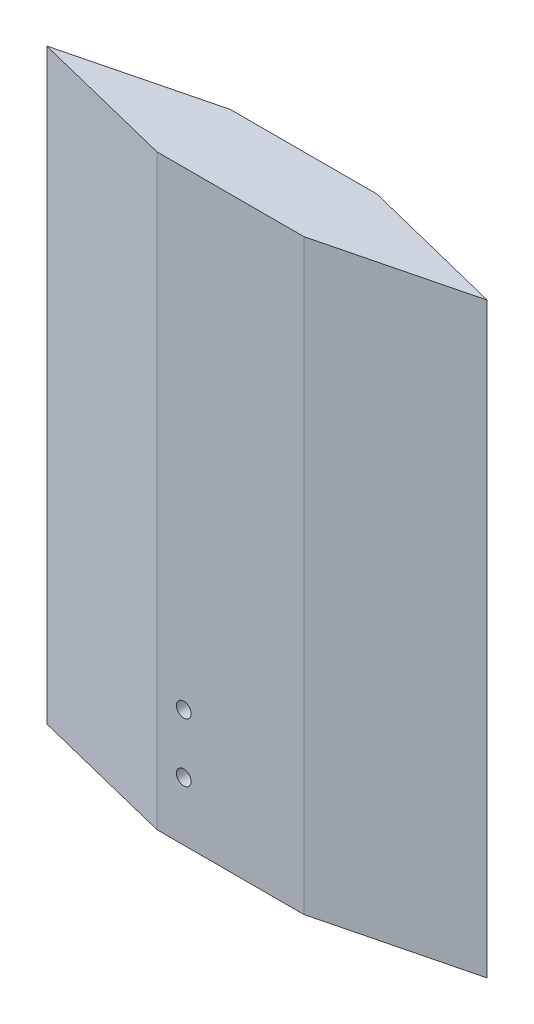
ISO-10303-21;
HEADER;
FILE_DESCRIPTION(('STEP AP214'),'2;1');
FILE_NAME('part.step','',(''),(''),'','','');
FILE_SCHEMA(('AUTOMOTIVE_DESIGN { 1 0 10303 214 1 1 1 1 }'));
ENDSEC;
DATA;
#1=APPLICATION_CONTEXT('core data for automotive mechanical design processes');
#2=APPLICATION_PROTOCOL_DEFINITION('international standard','automotive_design',2000,#1);
#3=PRODUCT_CONTEXT('',#1,'mechanical');
#4=PRODUCT('Part','Part','',(#3));
#5=PRODUCT_RELATED_PRODUCT_CATEGORY('part','',(#4));
#6=PRODUCT_DEFINITION_FORMATION('','',#4);
#7=PRODUCT_DEFINITION_CONTEXT('part definition',#1,'design');
#8=PRODUCT_DEFINITION('design','',#6,#7);
#9=PRODUCT_DEFINITION_SHAPE('','',#8);
#10=(LENGTH_UNIT() NAMED_UNIT(*) SI_UNIT(.MILLI.,.METRE.));
#11=(NAMED_UNIT(*) PLANE_ANGLE_UNIT() SI_UNIT($,.RADIAN.));
#12=(NAMED_UNIT(*) SI_UNIT($,.STERADIAN.) SOLID_ANGLE_UNIT());
#13=UNCERTAINTY_MEASURE_WITH_UNIT(LENGTH_MEASURE(1.E-05),#10,'distance_accuracy_value','');
#14=(GEOMETRIC_REPRESENTATION_CONTEXT(3) GLOBAL_UNCERTAINTY_ASSIGNED_CONTEXT((#13)) GLOBAL_UNIT_ASSIGNED_CONTEXT((#10,
#11,#12)) REPRESENTATION_CONTEXT('',''));
#15=CARTESIAN_POINT('',(0.,0.,0.));
#16=DIRECTION('',(0.,0.,1.));
#17=DIRECTION('',(1.,0.,0.));
#18=AXIS2_PLACEMENT_3D('',#15,#16,#17);
#19=CARTESIAN_POINT('',(-12.7,50.8,-3.1623));
#20=DIRECTION('',(0.241622227783842,0.,-0.970370392706194));
#21=DIRECTION('',(-0.970370392706194,0.,-0.241622227783842));
#22=AXIS2_PLACEMENT_3D('',#19,#20,#21);
#23=PLANE('',#22);
#24=DIRECTION('',(0.970370392706194,0.,0.241622227783842));
#25=VECTOR('',#24,1.);
#26=CARTESIAN_POINT('',(-12.7,0.,-3.1623));
#27=LINE('',#26,#25);
#28=CARTESIAN_POINT('',(-12.7,0.,-3.1623));
#29=VERTEX_POINT('',#28);
#30=CARTESIAN_POINT('',(0.,0.,0.));
#31=VERTEX_POINT('',#30);
#32=EDGE_CURVE('E141',#29,#31,#27,.T.);
#33=ORIENTED_EDGE('',*,*,#32,.T.);
#34=DIRECTION('',(0.,-1.,0.));
#35=VECTOR('',#34,1.);
#36=CARTESIAN_POINT('',(0.,50.8,0.));
#37=LINE('',#36,#35);
#38=CARTESIAN_POINT('',(0.,50.8,0.));
#39=VERTEX_POINT('',#38);
#40=EDGE_CURVE('E11',#39,#31,#37,.T.);
#41=ORIENTED_EDGE('',*,*,#40,.F.);
#42=DIRECTION('',(0.970370392706194,0.,0.241622227783842));
#43=VECTOR('',#42,1.);
#44=CARTESIAN_POINT('',(-12.7,50.8,-3.1623));
#45=LINE('',#44,#43);
#46=CARTESIAN_POINT('',(-12.7,50.8,-3.1623));
#47=VERTEX_POINT('',#46);
#48=EDGE_CURVE('E153',#47,#39,#45,.T.);
#49=ORIENTED_EDGE('',*,*,#48,.F.);
#50=DIRECTION('',(0.,-1.,0.));
#51=VECTOR('',#50,1.);
#52=CARTESIAN_POINT('',(-12.7,50.8,-3.1623));
#53=LINE('',#52,#51);
#54=EDGE_CURVE('E137',#47,#29,#53,.T.);
#55=ORIENTED_EDGE('',*,*,#54,.T.);
#56=EDGE_LOOP('',(#33,#41,#49,#55));
#57=FACE_BOUND('',#56,.T.);
#58=ADVANCED_FACE('F43',(#57),#23,.F.);
#59=CARTESIAN_POINT('',(0.,50.8,0.));
#60=DIRECTION('',(0.,0.,-1.));
#61=DIRECTION('',(-1.,0.,0.));
#62=AXIS2_PLACEMENT_3D('',#59,#60,#61);
#63=PLANE('',#62);
#64=CARTESIAN_POINT('',(2.31521,5.08,0.));
#65=DIRECTION('',(0.,0.,1.));
#66=DIRECTION('',(1.,0.,0.));
#67=AXIS2_PLACEMENT_3D('',#64,#65,#66);
#68=CIRCLE('',#67,0.635000000000001);
#69=CARTESIAN_POINT('',(2.95021,5.08,0.));
#70=VERTEX_POINT('',#69);
#71=EDGE_CURVE('E160',#70,#70,#68,.T.);
#72=ORIENTED_EDGE('',*,*,#71,.F.);
#73=EDGE_LOOP('',(#72));
#74=FACE_BOUND('',#73,.T.);
#75=CARTESIAN_POINT('',(2.31521,10.16,0.));
#76=DIRECTION('',(0.,0.,1.));
#77=DIRECTION('',(1.,0.,0.));
#78=AXIS2_PLACEMENT_3D('',#75,#76,#77);
#79=CIRCLE('',#78,0.635);
#80=CARTESIAN_POINT('',(2.95021,10.16,0.));
#81=VERTEX_POINT('',#80);
#82=EDGE_CURVE('E165',#81,#81,#79,.T.);
#83=ORIENTED_EDGE('',*,*,#82,.F.);
#84=EDGE_LOOP('',(#83));
#85=FACE_BOUND('',#84,.T.);
#86=DIRECTION('',(1.,0.,0.));
#87=VECTOR('',#86,1.);
#88=CARTESIAN_POINT('',(0.,0.,0.));
#89=LINE('',#88,#87);
#90=CARTESIAN_POINT('',(12.7,0.,0.));
#91=VERTEX_POINT('',#90);
#92=EDGE_CURVE('E144',#31,#91,#89,.T.);
#93=ORIENTED_EDGE('',*,*,#92,.T.);
#94=DIRECTION('',(0.,-1.,0.));
#95=VECTOR('',#94,1.);
#96=CARTESIAN_POINT('',(12.7,50.8,0.));
#97=LINE('',#96,#95);
#98=CARTESIAN_POINT('',(12.7,50.8,0.));
#99=VERTEX_POINT('',#98);
#100=EDGE_CURVE('E51',#99,#91,#97,.T.);
#101=ORIENTED_EDGE('',*,*,#100,.F.);
#102=DIRECTION('',(1.,0.,0.));
#103=VECTOR('',#102,1.);
#104=CARTESIAN_POINT('',(0.,50.8,0.));
#105=LINE('',#104,#103);
#106=EDGE_CURVE('E103',#39,#99,#105,.T.);
#107=ORIENTED_EDGE('',*,*,#106,.F.);
#108=ORIENTED_EDGE('',*,*,#40,.T.);
#109=EDGE_LOOP('',(#93,#101,#107,#108));
#110=FACE_BOUND('',#109,.T.);
#111=ADVANCED_FACE('F206',(#74,#85,#110),#63,.F.);
#112=CARTESIAN_POINT('',(12.7,50.8,0.));
#113=DIRECTION('',(-0.242535625036333,0.,-0.970142500145332));
#114=DIRECTION('',(-0.970142500145332,0.,0.242535625036333));
#115=AXIS2_PLACEMENT_3D('',#112,#113,#114);
#116=PLANE('',#115);
#117=DIRECTION('',(0.970142500145332,0.,-0.242535625036333));
#118=VECTOR('',#117,1.);
#119=CARTESIAN_POINT('',(12.7,0.,0.));
#120=LINE('',#119,#118);
#121=CARTESIAN_POINT('',(25.4,0.,-3.175));
#122=VERTEX_POINT('',#121);
#123=EDGE_CURVE('E147',#91,#122,#120,.T.);
#124=ORIENTED_EDGE('',*,*,#123,.T.);
#125=DIRECTION('',(0.,-1.,0.));
#126=VECTOR('',#125,1.);
#127=CARTESIAN_POINT('',(25.4,50.8,-3.175));
#128=LINE('',#127,#126);
#129=CARTESIAN_POINT('',(25.4,50.8,-3.175));
#130=VERTEX_POINT('',#129);
#131=EDGE_CURVE('E132',#130,#122,#128,.T.);
#132=ORIENTED_EDGE('',*,*,#131,.F.);
#133=DIRECTION('',(0.970142500145332,0.,-0.242535625036333));
#134=VECTOR('',#133,1.);
#135=CARTESIAN_POINT('',(12.7,50.8,0.));
#136=LINE('',#135,#134);
#137=EDGE_CURVE('E120',#99,#130,#136,.T.);
#138=ORIENTED_EDGE('',*,*,#137,.F.);
#139=ORIENTED_EDGE('',*,*,#100,.T.);
#140=EDGE_LOOP('',(#124,#132,#138,#139));
#141=FACE_BOUND('',#140,.T.);
#142=ADVANCED_FACE('F209',(#141),#116,.F.);
#143=CARTESIAN_POINT('',(25.4,50.8,-3.175));
#144=DIRECTION('',(-0.242535625036333,0.,0.970142500145332));
#145=DIRECTION('',(0.970142500145332,0.,0.242535625036333));
#146=AXIS2_PLACEMENT_3D('',#143,#144,#145);
#147=PLANE('',#146);
#148=DIRECTION('',(-0.970142500145332,0.,-0.242535625036333));
#149=VECTOR('',#148,1.);
#150=CARTESIAN_POINT('',(25.4,0.,-3.175));
#151=LINE('',#150,#149);
#152=CARTESIAN_POINT('',(12.7,0.,-6.35));
#153=VERTEX_POINT('',#152);
#154=EDGE_CURVE('E129',#122,#153,#151,.T.);
#155=ORIENTED_EDGE('',*,*,#154,.T.);
#156=DIRECTION('',(0.,-1.,0.));
#157=VECTOR('',#156,1.);
#158=CARTESIAN_POINT('',(12.7,50.8,-6.35));
#159=LINE('',#158,#157);
#160=CARTESIAN_POINT('',(12.7,50.8,-6.35));
#161=VERTEX_POINT('',#160);
#162=EDGE_CURVE('E126',#161,#153,#159,.T.);
#163=ORIENTED_EDGE('',*,*,#162,.F.);
#164=DIRECTION('',(-0.970142500145332,0.,-0.242535625036333));
#165=VECTOR('',#164,1.);
#166=CARTESIAN_POINT('',(25.4,50.8,-3.175));
#167=LINE('',#166,#165);
#168=EDGE_CURVE('E113',#130,#161,#167,.T.);
#169=ORIENTED_EDGE('',*,*,#168,.F.);
#170=ORIENTED_EDGE('',*,*,#131,.T.);
#171=EDGE_LOOP('',(#155,#163,#169,#170));
#172=FACE_BOUND('',#171,.T.);
#173=ADVANCED_FACE('F127',(#172),#147,.F.);
#174=CARTESIAN_POINT('',(0.,50.8,-6.35));
#175=DIRECTION('',(0.,0.,1.));
#176=DIRECTION('',(1.,0.,0.));
#177=AXIS2_PLACEMENT_3D('',#174,#175,#176);
#178=PLANE('',#177);
#179=DIRECTION('',(-1.,0.,0.));
#180=VECTOR('',#179,1.);
#181=CARTESIAN_POINT('',(0.,0.,-6.35));
#182=LINE('',#181,#180);
#183=CARTESIAN_POINT('',(0.,0.,-6.35));
#184=VERTEX_POINT('',#183);
#185=EDGE_CURVE('E150',#153,#184,#182,.T.);
#186=ORIENTED_EDGE('',*,*,#185,.T.);
#187=DIRECTION('',(0.,-1.,0.));
#188=VECTOR('',#187,1.);
#189=CARTESIAN_POINT('',(0.,50.8,-6.35));
#190=LINE('',#189,#188);
#191=CARTESIAN_POINT('',(0.,50.8,-6.35));
#192=VERTEX_POINT('',#191);
#193=EDGE_CURVE('E133',#192,#184,#190,.T.);
#194=ORIENTED_EDGE('',*,*,#193,.F.);
#195=DIRECTION('',(-1.,0.,0.));
#196=VECTOR('',#195,1.);
#197=CARTESIAN_POINT('',(0.,50.8,-6.35));
#198=LINE('',#197,#196);
#199=EDGE_CURVE('E117',#161,#192,#198,.T.);
#200=ORIENTED_EDGE('',*,*,#199,.F.);
#201=ORIENTED_EDGE('',*,*,#162,.T.);
#202=EDGE_LOOP('',(#186,#194,#200,#201));
#203=FACE_BOUND('',#202,.T.);
#204=ADVANCED_FACE('F135',(#203),#178,.F.);
#205=CARTESIAN_POINT('',(0.,50.8,-6.35));
#206=DIRECTION('',(0.243448377765741,0.,0.969913855640401));
#207=DIRECTION('',(0.969913855640401,0.,-0.243448377765741));
#208=AXIS2_PLACEMENT_3D('',#205,#206,#207);
#209=PLANE('',#208);
#210=DIRECTION('',(-0.969913855640401,0.,0.243448377765741));
#211=VECTOR('',#210,1.);
#212=CARTESIAN_POINT('',(0.,0.,-6.35));
#213=LINE('',#212,#211);
#214=EDGE_CURVE('E95',#184,#29,#213,.T.);
#215=ORIENTED_EDGE('',*,*,#214,.T.);
#216=ORIENTED_EDGE('',*,*,#54,.F.);
#217=DIRECTION('',(-0.969913855640401,0.,0.243448377765741));
#218=VECTOR('',#217,1.);
#219=CARTESIAN_POINT('',(0.,50.8,-6.35));
#220=LINE('',#219,#218);
#221=EDGE_CURVE('E68',#192,#47,#220,.T.);
#222=ORIENTED_EDGE('',*,*,#221,.F.);
#223=ORIENTED_EDGE('',*,*,#193,.T.);
#224=EDGE_LOOP('',(#215,#216,#222,#223));
#225=FACE_BOUND('',#224,.T.);
#226=ADVANCED_FACE('F213',(#225),#209,.F.);
#227=CARTESIAN_POINT('',(0.,50.8,0.));
#228=DIRECTION('',(0.,-1.,0.));
#229=DIRECTION('',(0.,0.,-1.));
#230=AXIS2_PLACEMENT_3D('',#227,#228,#229);
#231=PLANE('',#230);
#232=ORIENTED_EDGE('',*,*,#48,.T.);
#233=ORIENTED_EDGE('',*,*,#106,.T.);
#234=ORIENTED_EDGE('',*,*,#137,.T.);
#235=ORIENTED_EDGE('',*,*,#168,.T.);
#236=ORIENTED_EDGE('',*,*,#199,.T.);
#237=ORIENTED_EDGE('',*,*,#221,.T.);
#238=EDGE_LOOP('',(#232,#233,#234,#235,#236,#237));
#239=FACE_BOUND('',#238,.T.);
#240=ADVANCED_FACE('F115',(#239),#231,.F.);
#241=CARTESIAN_POINT('',(0.,0.,0.));
#242=DIRECTION('',(0.,-1.,0.));
#243=DIRECTION('',(0.,0.,-1.));
#244=AXIS2_PLACEMENT_3D('',#241,#242,#243);
#245=PLANE('',#244);
#246=DIRECTION('',(-1.,0.,0.));
#247=VECTOR('',#246,1.);
#248=CARTESIAN_POINT('',(3.175,0.,-2.54));
#249=LINE('',#248,#247);
#250=CARTESIAN_POINT('',(3.175,0.,-2.54));
#251=VERTEX_POINT('',#250);
#252=CARTESIAN_POINT('',(1.45496778314848,0.,-2.54));
#253=VERTEX_POINT('',#252);
#254=EDGE_CURVE('E59',#251,#253,#249,.T.);
#255=ORIENTED_EDGE('',*,*,#254,.F.);
#256=DIRECTION('',(0.,0.,1.));
#257=VECTOR('',#256,1.);
#258=CARTESIAN_POINT('',(3.175,0.,-2.54));
#259=LINE('',#258,#257);
#260=CARTESIAN_POINT('',(3.175,0.,-3.81));
#261=VERTEX_POINT('',#260);
#262=EDGE_CURVE('E176',#261,#251,#259,.T.);
#263=ORIENTED_EDGE('',*,*,#262,.F.);
#264=DIRECTION('',(1.,0.,0.));
#265=VECTOR('',#264,1.);
#266=CARTESIAN_POINT('',(3.175,0.,-3.81));
#267=LINE('',#266,#265);
#268=CARTESIAN_POINT('',(1.45496778314848,0.,-3.81));
#269=VERTEX_POINT('',#268);
#270=EDGE_CURVE('E190',#269,#261,#267,.T.);
#271=ORIENTED_EDGE('',*,*,#270,.F.);
#272=CARTESIAN_POINT('',(0.,0.,-3.175));
#273=DIRECTION('',(0.,-1.,0.));
#274=DIRECTION('',(0.,0.,-1.));
#275=AXIS2_PLACEMENT_3D('',#272,#273,#274);
#276=CIRCLE('',#275,1.5875);
#277=EDGE_CURVE('E187',#253,#269,#276,.T.);
#278=ORIENTED_EDGE('',*,*,#277,.F.);
#279=EDGE_LOOP('',(#255,#263,#271,#278));
#280=FACE_BOUND('',#279,.T.);
#281=ORIENTED_EDGE('',*,*,#32,.F.);
#282=ORIENTED_EDGE('',*,*,#214,.F.);
#283=ORIENTED_EDGE('',*,*,#185,.F.);
#284=ORIENTED_EDGE('',*,*,#154,.F.);
#285=ORIENTED_EDGE('',*,*,#123,.F.);
#286=ORIENTED_EDGE('',*,*,#92,.F.);
#287=EDGE_LOOP('',(#281,#282,#283,#284,#285,#286));
#288=FACE_BOUND('',#287,.T.);
#289=ADVANCED_FACE('F212',(#280,#288),#245,.T.);
#290=CARTESIAN_POINT('',(3.175,16.51,-2.54));
#291=DIRECTION('',(0.,0.,1.));
#292=DIRECTION('',(1.,0.,0.));
#293=AXIS2_PLACEMENT_3D('',#290,#291,#292);
#294=PLANE('',#293);
#295=CARTESIAN_POINT('',(2.31521,5.08,-2.54));
#296=DIRECTION('',(0.,0.,1.));
#297=DIRECTION('',(1.,0.,0.));
#298=AXIS2_PLACEMENT_3D('',#295,#296,#297);
#299=CIRCLE('',#298,0.635000000000001);
#300=CARTESIAN_POINT('',(2.95021,5.08,-2.54));
#301=VERTEX_POINT('',#300);
#302=EDGE_CURVE('E46',#301,#301,#299,.T.);
#303=ORIENTED_EDGE('',*,*,#302,.T.);
#304=EDGE_LOOP('',(#303));
#305=FACE_BOUND('',#304,.T.);
#306=CARTESIAN_POINT('',(2.31521,10.16,-2.54));
#307=DIRECTION('',(0.,0.,1.));
#308=DIRECTION('',(1.,0.,0.));
#309=AXIS2_PLACEMENT_3D('',#306,#307,#308);
#310=CIRCLE('',#309,0.635);
#311=CARTESIAN_POINT('',(2.95021,10.16,-2.54));
#312=VERTEX_POINT('',#311);
#313=EDGE_CURVE('E158',#312,#312,#310,.T.);
#314=ORIENTED_EDGE('',*,*,#313,.T.);
#315=EDGE_LOOP('',(#314));
#316=FACE_BOUND('',#315,.T.);
#317=ORIENTED_EDGE('',*,*,#254,.T.);
#318=DIRECTION('',(0.,-1.,0.));
#319=VECTOR('',#318,1.);
#320=CARTESIAN_POINT('',(1.45496778314848,16.51,-2.54));
#321=LINE('',#320,#319);
#322=CARTESIAN_POINT('',(1.45496778314848,16.51,-2.54));
#323=VERTEX_POINT('',#322);
#324=EDGE_CURVE('E185',#323,#253,#321,.T.);
#325=ORIENTED_EDGE('',*,*,#324,.F.);
#326=DIRECTION('',(-1.,0.,0.));
#327=VECTOR('',#326,1.);
#328=CARTESIAN_POINT('',(3.175,16.51,-2.54));
#329=LINE('',#328,#327);
#330=CARTESIAN_POINT('',(3.175,16.51,-2.54));
#331=VERTEX_POINT('',#330);
#332=EDGE_CURVE('E172',#331,#323,#329,.T.);
#333=ORIENTED_EDGE('',*,*,#332,.F.);
#334=DIRECTION('',(0.,-1.,0.));
#335=VECTOR('',#334,1.);
#336=CARTESIAN_POINT('',(3.175,16.51,-2.54));
#337=LINE('',#336,#335);
#338=EDGE_CURVE('E145',#331,#251,#337,.T.);
#339=ORIENTED_EDGE('',*,*,#338,.T.);
#340=EDGE_LOOP('',(#317,#325,#333,#339));
#341=FACE_BOUND('',#340,.T.);
#342=ADVANCED_FACE('F236',(#305,#316,#341),#294,.F.);
#343=CARTESIAN_POINT('',(3.175,16.51,-2.54));
#344=DIRECTION('',(1.,0.,0.));
#345=DIRECTION('',(0.,0.,-1.));
#346=AXIS2_PLACEMENT_3D('',#343,#344,#345);
#347=PLANE('',#346);
#348=ORIENTED_EDGE('',*,*,#262,.T.);
#349=ORIENTED_EDGE('',*,*,#338,.F.);
#350=DIRECTION('',(0.,0.,1.));
#351=VECTOR('',#350,1.);
#352=CARTESIAN_POINT('',(3.175,16.51,-2.54));
#353=LINE('',#352,#351);
#354=CARTESIAN_POINT('',(3.175,16.51,-3.81));
#355=VERTEX_POINT('',#354);
#356=EDGE_CURVE('E182',#355,#331,#353,.T.);
#357=ORIENTED_EDGE('',*,*,#356,.F.);
#358=DIRECTION('',(0.,-1.,0.));
#359=VECTOR('',#358,1.);
#360=CARTESIAN_POINT('',(3.175,16.51,-3.81));
#361=LINE('',#360,#359);
#362=EDGE_CURVE('E196',#355,#261,#361,.T.);
#363=ORIENTED_EDGE('',*,*,#362,.T.);
#364=EDGE_LOOP('',(#348,#349,#357,#363));
#365=FACE_BOUND('',#364,.T.);
#366=ADVANCED_FACE('F241',(#365),#347,.F.);
#367=CARTESIAN_POINT('',(3.175,16.51,-3.81));
#368=DIRECTION('',(0.,0.,-1.));
#369=DIRECTION('',(-1.,0.,0.));
#370=AXIS2_PLACEMENT_3D('',#367,#368,#369);
#371=PLANE('',#370);
#372=ORIENTED_EDGE('',*,*,#270,.T.);
#373=ORIENTED_EDGE('',*,*,#362,.F.);
#374=DIRECTION('',(1.,0.,0.));
#375=VECTOR('',#374,1.);
#376=CARTESIAN_POINT('',(3.175,16.51,-3.81));
#377=LINE('',#376,#375);
#378=CARTESIAN_POINT('',(1.45496778314848,16.51,-3.81));
#379=VERTEX_POINT('',#378);
#380=EDGE_CURVE('E179',#379,#355,#377,.T.);
#381=ORIENTED_EDGE('',*,*,#380,.F.);
#382=DIRECTION('',(0.,-1.,0.));
#383=VECTOR('',#382,1.);
#384=CARTESIAN_POINT('',(1.45496778314848,16.51,-3.81));
#385=LINE('',#384,#383);
#386=EDGE_CURVE('E199',#379,#269,#385,.T.);
#387=ORIENTED_EDGE('',*,*,#386,.T.);
#388=EDGE_LOOP('',(#372,#373,#381,#387));
#389=FACE_BOUND('',#388,.T.);
#390=ADVANCED_FACE('F247',(#389),#371,.F.);
#391=CARTESIAN_POINT('',(0.,16.51,-3.175));
#392=DIRECTION('',(0.,-1.,0.));
#393=DIRECTION('',(0.,0.,-1.));
#394=AXIS2_PLACEMENT_3D('',#391,#392,#393);
#395=CYLINDRICAL_SURFACE('',#394,1.5875);
#396=ORIENTED_EDGE('',*,*,#277,.T.);
#397=ORIENTED_EDGE('',*,*,#386,.F.);
#398=CARTESIAN_POINT('',(0.,16.51,-3.175));
#399=DIRECTION('',(0.,-1.,0.));
#400=DIRECTION('',(0.,0.,-1.));
#401=AXIS2_PLACEMENT_3D('',#398,#399,#400);
#402=CIRCLE('',#401,1.5875);
#403=EDGE_CURVE('E175',#323,#379,#402,.T.);
#404=ORIENTED_EDGE('',*,*,#403,.F.);
#405=ORIENTED_EDGE('',*,*,#324,.T.);
#406=EDGE_LOOP('',(#396,#397,#404,#405));
#407=FACE_BOUND('',#406,.T.);
#408=ADVANCED_FACE('F243',(#407),#395,.F.);
#409=CARTESIAN_POINT('',(0.,16.51,-3.175));
#410=DIRECTION('',(0.,-1.,0.));
#411=DIRECTION('',(0.,0.,-1.));
#412=AXIS2_PLACEMENT_3D('',#409,#410,#411);
#413=PLANE('',#412);
#414=ORIENTED_EDGE('',*,*,#332,.T.);
#415=ORIENTED_EDGE('',*,*,#403,.T.);
#416=ORIENTED_EDGE('',*,*,#380,.T.);
#417=ORIENTED_EDGE('',*,*,#356,.T.);
#418=EDGE_LOOP('',(#414,#415,#416,#417));
#419=FACE_BOUND('',#418,.T.);
#420=ADVANCED_FACE('F246',(#419),#413,.T.);
#421=CARTESIAN_POINT('',(2.31521,10.16,-3.175));
#422=DIRECTION('',(0.,0.,1.));
#423=DIRECTION('',(1.,0.,0.));
#424=AXIS2_PLACEMENT_3D('',#421,#422,#423);
#425=CYLINDRICAL_SURFACE('',#424,0.635);
#426=ORIENTED_EDGE('',*,*,#82,.T.);
#427=EDGE_LOOP('',(#426));
#428=FACE_BOUND('',#427,.T.);
#429=ORIENTED_EDGE('',*,*,#313,.F.);
#430=EDGE_LOOP('',(#429));
#431=FACE_BOUND('',#430,.T.);
#432=ADVANCED_FACE('F256',(#428,#431),#425,.F.);
#433=CARTESIAN_POINT('',(2.31521,5.08,-3.175));
#434=DIRECTION('',(0.,0.,1.));
#435=DIRECTION('',(1.,0.,0.));
#436=AXIS2_PLACEMENT_3D('',#433,#434,#435);
#437=CYLINDRICAL_SURFACE('',#436,0.635000000000001);
#438=ORIENTED_EDGE('',*,*,#71,.T.);
#439=EDGE_LOOP('',(#438));
#440=FACE_BOUND('',#439,.T.);
#441=ORIENTED_EDGE('',*,*,#302,.F.);
#442=EDGE_LOOP('',(#441));
#443=FACE_BOUND('',#442,.T.);
#444=ADVANCED_FACE('F260',(#440,#443),#437,.F.);
#445=CLOSED_SHELL('',(#58,#111,#142,#173,#204,#226,#240,#289,#342,#366,#390,#408,#420,#432,#444));
#446=MANIFOLD_SOLID_BREP('B2',#445);
#447=ADVANCED_BREP_SHAPE_REPRESENTATION('',(#18,#446),#14);
#448=SHAPE_DEFINITION_REPRESENTATION(#9,#447);
ENDSEC;
END-ISO-10303-21;
